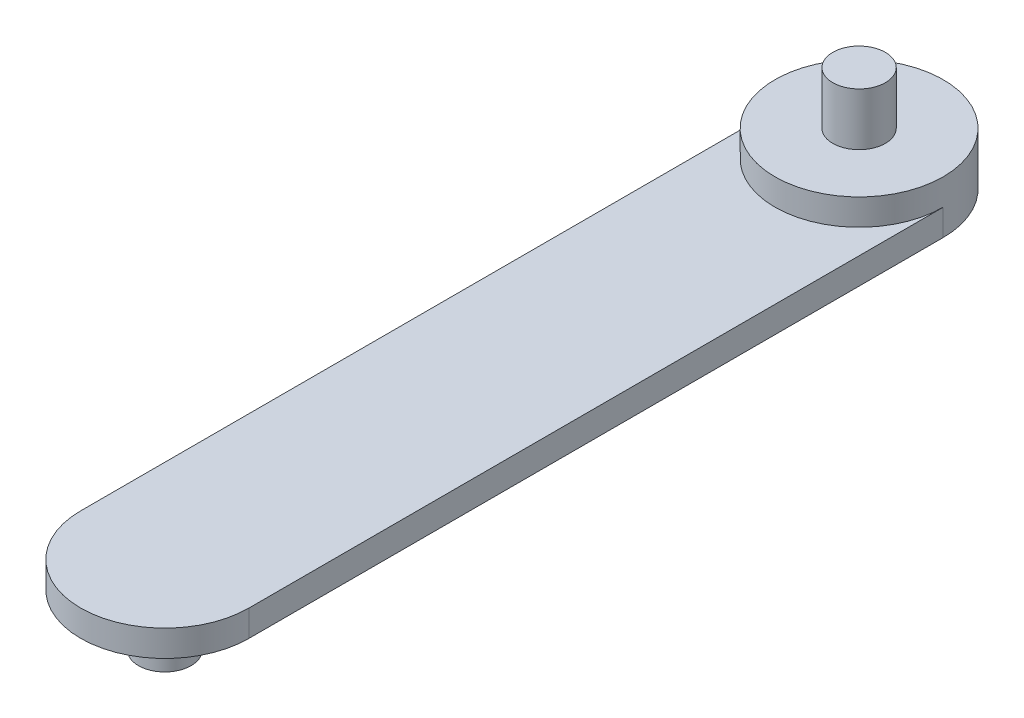
ISO-10303-21;
HEADER;
FILE_DESCRIPTION(('STEP AP214'),'2;1');
FILE_NAME('part.step','',(''),(''),'','','');
FILE_SCHEMA(('AUTOMOTIVE_DESIGN { 1 0 10303 214 1 1 1 1 }'));
ENDSEC;
DATA;
#1=APPLICATION_CONTEXT('core data for automotive mechanical design processes');
#2=APPLICATION_PROTOCOL_DEFINITION('international standard','automotive_design',2000,#1);
#3=PRODUCT_CONTEXT('',#1,'mechanical');
#4=PRODUCT('Part','Part','',(#3));
#5=PRODUCT_RELATED_PRODUCT_CATEGORY('part','',(#4));
#6=PRODUCT_DEFINITION_FORMATION('','',#4);
#7=PRODUCT_DEFINITION_CONTEXT('part definition',#1,'design');
#8=PRODUCT_DEFINITION('design','',#6,#7);
#9=PRODUCT_DEFINITION_SHAPE('','',#8);
#10=(LENGTH_UNIT() NAMED_UNIT(*) SI_UNIT(.MILLI.,.METRE.));
#11=(NAMED_UNIT(*) PLANE_ANGLE_UNIT() SI_UNIT($,.RADIAN.));
#12=(NAMED_UNIT(*) SI_UNIT($,.STERADIAN.) SOLID_ANGLE_UNIT());
#13=UNCERTAINTY_MEASURE_WITH_UNIT(LENGTH_MEASURE(1.E-05),#10,'distance_accuracy_value','');
#14=(GEOMETRIC_REPRESENTATION_CONTEXT(3) GLOBAL_UNCERTAINTY_ASSIGNED_CONTEXT((#13)) GLOBAL_UNIT_ASSIGNED_CONTEXT((#10,
#11,#12)) REPRESENTATION_CONTEXT('',''));
#15=CARTESIAN_POINT('',(0.,0.,0.));
#16=DIRECTION('',(0.,0.,1.));
#17=DIRECTION('',(1.,0.,0.));
#18=AXIS2_PLACEMENT_3D('',#15,#16,#17);
#19=CARTESIAN_POINT('',(0.,2.5,-33.));
#20=DIRECTION('',(0.,-1.,0.));
#21=DIRECTION('',(0.,0.,-1.));
#22=AXIS2_PLACEMENT_3D('',#19,#20,#21);
#23=CYLINDRICAL_SURFACE('',#22,4.);
#24=CARTESIAN_POINT('',(0.,1.25,-33.));
#25=DIRECTION('',(0.,1.,0.));
#26=DIRECTION('',(0.,0.,1.));
#27=AXIS2_PLACEMENT_3D('',#24,#25,#26);
#28=CIRCLE('',#27,4.);
#29=CARTESIAN_POINT('',(-4.,1.25,-33.));
#30=VERTEX_POINT('',#29);
#31=CARTESIAN_POINT('',(4.,1.25,-33.));
#32=VERTEX_POINT('',#31);
#33=EDGE_CURVE('E47',#30,#32,#28,.T.);
#34=ORIENTED_EDGE('',*,*,#33,.T.);
#35=DIRECTION('',(0.,-1.,0.));
#36=VECTOR('',#35,1.);
#37=CARTESIAN_POINT('',(4.,1.25,-33.));
#38=LINE('',#37,#36);
#39=CARTESIAN_POINT('',(4.,0.,-33.));
#40=VERTEX_POINT('',#39);
#41=EDGE_CURVE('E105',#32,#40,#38,.T.);
#42=ORIENTED_EDGE('',*,*,#41,.T.);
#43=CARTESIAN_POINT('',(0.,0.,-33.));
#44=DIRECTION('',(0.,1.,0.));
#45=DIRECTION('',(0.,0.,1.));
#46=AXIS2_PLACEMENT_3D('',#43,#44,#45);
#47=CIRCLE('',#46,4.);
#48=CARTESIAN_POINT('',(-4.,0.,-33.));
#49=VERTEX_POINT('',#48);
#50=EDGE_CURVE('E107',#40,#49,#47,.T.);
#51=ORIENTED_EDGE('',*,*,#50,.T.);
#52=DIRECTION('',(0.,-1.,0.));
#53=VECTOR('',#52,1.);
#54=CARTESIAN_POINT('',(-4.,1.25,-33.));
#55=LINE('',#54,#53);
#56=EDGE_CURVE('E52',#30,#49,#55,.T.);
#57=ORIENTED_EDGE('',*,*,#56,.F.);
#58=EDGE_LOOP('',(#34,#42,#51,#57));
#59=FACE_BOUND('',#58,.T.);
#60=CARTESIAN_POINT('',(0.,2.5,-33.));
#61=DIRECTION('',(0.,1.,0.));
#62=DIRECTION('',(0.,0.,1.));
#63=AXIS2_PLACEMENT_3D('',#60,#61,#62);
#64=CIRCLE('',#63,4.);
#65=CARTESIAN_POINT('',(0.,2.5,-29.));
#66=VERTEX_POINT('',#65);
#67=EDGE_CURVE('E108',#66,#66,#64,.T.);
#68=ORIENTED_EDGE('',*,*,#67,.F.);
#69=EDGE_LOOP('',(#68));
#70=FACE_BOUND('',#69,.T.);
#71=ADVANCED_FACE('F33',(#59,#70),#23,.T.);
#72=CARTESIAN_POINT('',(0.,2.5,0.));
#73=DIRECTION('',(0.,1.,0.));
#74=DIRECTION('',(0.,0.,1.));
#75=AXIS2_PLACEMENT_3D('',#72,#73,#74);
#76=PLANE('',#75);
#77=CARTESIAN_POINT('',(0.,2.5,-33.));
#78=DIRECTION('',(0.,1.,0.));
#79=DIRECTION('',(0.,0.,1.));
#80=AXIS2_PLACEMENT_3D('',#77,#78,#79);
#81=CIRCLE('',#80,1.25);
#82=CARTESIAN_POINT('',(0.,2.5,-31.75));
#83=VERTEX_POINT('',#82);
#84=EDGE_CURVE('E40',#83,#83,#81,.T.);
#85=ORIENTED_EDGE('',*,*,#84,.F.);
#86=EDGE_LOOP('',(#85));
#87=FACE_BOUND('',#86,.T.);
#88=ORIENTED_EDGE('',*,*,#67,.T.);
#89=EDGE_LOOP('',(#88));
#90=FACE_BOUND('',#89,.T.);
#91=ADVANCED_FACE('F136',(#87,#90),#76,.T.);
#92=CARTESIAN_POINT('',(0.,0.,0.));
#93=DIRECTION('',(0.,1.,0.));
#94=DIRECTION('',(0.,0.,1.));
#95=AXIS2_PLACEMENT_3D('',#92,#93,#94);
#96=PLANE('',#95);
#97=CARTESIAN_POINT('',(0.,0.,0.));
#98=DIRECTION('',(0.,1.,0.));
#99=DIRECTION('',(0.,0.,1.));
#100=AXIS2_PLACEMENT_3D('',#97,#98,#99);
#101=CIRCLE('',#100,1.25);
#102=CARTESIAN_POINT('',(0.,0.,1.25));
#103=VERTEX_POINT('',#102);
#104=EDGE_CURVE('E11',#103,#103,#101,.F.);
#105=ORIENTED_EDGE('',*,*,#104,.F.);
#106=EDGE_LOOP('',(#105));
#107=FACE_BOUND('',#106,.T.);
#108=ORIENTED_EDGE('',*,*,#50,.F.);
#109=DIRECTION('',(0.,0.,-1.));
#110=VECTOR('',#109,1.);
#111=CARTESIAN_POINT('',(4.,0.,0.));
#112=LINE('',#111,#110);
#113=CARTESIAN_POINT('',(4.,0.,0.));
#114=VERTEX_POINT('',#113);
#115=EDGE_CURVE('E96',#114,#40,#112,.T.);
#116=ORIENTED_EDGE('',*,*,#115,.F.);
#117=CARTESIAN_POINT('',(0.,0.,0.));
#118=DIRECTION('',(0.,1.,0.));
#119=DIRECTION('',(0.,0.,1.));
#120=AXIS2_PLACEMENT_3D('',#117,#118,#119);
#121=CIRCLE('',#120,4.);
#122=CARTESIAN_POINT('',(-4.,0.,0.));
#123=VERTEX_POINT('',#122);
#124=EDGE_CURVE('E101',#123,#114,#121,.T.);
#125=ORIENTED_EDGE('',*,*,#124,.F.);
#126=DIRECTION('',(0.,0.,-1.));
#127=VECTOR('',#126,1.);
#128=CARTESIAN_POINT('',(-4.,0.,0.));
#129=LINE('',#128,#127);
#130=EDGE_CURVE('E78',#123,#49,#129,.T.);
#131=ORIENTED_EDGE('',*,*,#130,.T.);
#132=EDGE_LOOP('',(#108,#116,#125,#131));
#133=FACE_BOUND('',#132,.T.);
#134=ADVANCED_FACE('F114',(#107,#133),#96,.F.);
#135=CARTESIAN_POINT('',(4.,1.25,0.));
#136=DIRECTION('',(-1.,0.,0.));
#137=DIRECTION('',(0.,0.,1.));
#138=AXIS2_PLACEMENT_3D('',#135,#136,#137);
#139=PLANE('',#138);
#140=ORIENTED_EDGE('',*,*,#115,.T.);
#141=ORIENTED_EDGE('',*,*,#41,.F.);
#142=DIRECTION('',(0.,0.,-1.));
#143=VECTOR('',#142,1.);
#144=CARTESIAN_POINT('',(4.,1.25,0.));
#145=LINE('',#144,#143);
#146=CARTESIAN_POINT('',(4.,1.25,0.));
#147=VERTEX_POINT('',#146);
#148=EDGE_CURVE('E92',#147,#32,#145,.T.);
#149=ORIENTED_EDGE('',*,*,#148,.F.);
#150=DIRECTION('',(0.,-1.,0.));
#151=VECTOR('',#150,1.);
#152=CARTESIAN_POINT('',(4.,1.25,0.));
#153=LINE('',#152,#151);
#154=EDGE_CURVE('E81',#147,#114,#153,.T.);
#155=ORIENTED_EDGE('',*,*,#154,.T.);
#156=EDGE_LOOP('',(#140,#141,#149,#155));
#157=FACE_BOUND('',#156,.T.);
#158=ADVANCED_FACE('F116',(#157),#139,.F.);
#159=CARTESIAN_POINT('',(-4.,1.25,0.));
#160=DIRECTION('',(-1.,0.,0.));
#161=DIRECTION('',(0.,0.,1.));
#162=AXIS2_PLACEMENT_3D('',#159,#160,#161);
#163=PLANE('',#162);
#164=ORIENTED_EDGE('',*,*,#130,.F.);
#165=DIRECTION('',(0.,-1.,0.));
#166=VECTOR('',#165,1.);
#167=CARTESIAN_POINT('',(-4.,1.25,0.));
#168=LINE('',#167,#166);
#169=CARTESIAN_POINT('',(-4.,1.25,0.));
#170=VERTEX_POINT('',#169);
#171=EDGE_CURVE('E72',#170,#123,#168,.T.);
#172=ORIENTED_EDGE('',*,*,#171,.F.);
#173=DIRECTION('',(0.,0.,-1.));
#174=VECTOR('',#173,1.);
#175=CARTESIAN_POINT('',(-4.,1.25,0.));
#176=LINE('',#175,#174);
#177=EDGE_CURVE('E76',#170,#30,#176,.T.);
#178=ORIENTED_EDGE('',*,*,#177,.T.);
#179=ORIENTED_EDGE('',*,*,#56,.T.);
#180=EDGE_LOOP('',(#164,#172,#178,#179));
#181=FACE_BOUND('',#180,.T.);
#182=ADVANCED_FACE('F74',(#181),#163,.T.);
#183=CARTESIAN_POINT('',(0.,1.25,0.));
#184=DIRECTION('',(0.,-1.,0.));
#185=DIRECTION('',(0.,0.,-1.));
#186=AXIS2_PLACEMENT_3D('',#183,#184,#185);
#187=CYLINDRICAL_SURFACE('',#186,4.);
#188=ORIENTED_EDGE('',*,*,#124,.T.);
#189=ORIENTED_EDGE('',*,*,#154,.F.);
#190=CARTESIAN_POINT('',(0.,1.25,0.));
#191=DIRECTION('',(0.,1.,0.));
#192=DIRECTION('',(0.,0.,1.));
#193=AXIS2_PLACEMENT_3D('',#190,#191,#192);
#194=CIRCLE('',#193,4.);
#195=EDGE_CURVE('E84',#170,#147,#194,.T.);
#196=ORIENTED_EDGE('',*,*,#195,.F.);
#197=ORIENTED_EDGE('',*,*,#171,.T.);
#198=EDGE_LOOP('',(#188,#189,#196,#197));
#199=FACE_BOUND('',#198,.T.);
#200=ADVANCED_FACE('F85',(#199),#187,.T.);
#201=CARTESIAN_POINT('',(0.,1.25,0.));
#202=DIRECTION('',(0.,1.,0.));
#203=DIRECTION('',(0.,0.,1.));
#204=AXIS2_PLACEMENT_3D('',#201,#202,#203);
#205=PLANE('',#204);
#206=ORIENTED_EDGE('',*,*,#148,.T.);
#207=ORIENTED_EDGE('',*,*,#33,.F.);
#208=ORIENTED_EDGE('',*,*,#177,.F.);
#209=ORIENTED_EDGE('',*,*,#195,.T.);
#210=EDGE_LOOP('',(#206,#207,#208,#209));
#211=FACE_BOUND('',#210,.T.);
#212=ADVANCED_FACE('F90',(#211),#205,.T.);
#213=CARTESIAN_POINT('',(0.,5.,-33.));
#214=DIRECTION('',(0.,-1.,0.));
#215=DIRECTION('',(0.,0.,-1.));
#216=AXIS2_PLACEMENT_3D('',#213,#214,#215);
#217=CYLINDRICAL_SURFACE('',#216,1.25);
#218=CARTESIAN_POINT('',(0.,5.,-33.));
#219=DIRECTION('',(0.,1.,0.));
#220=DIRECTION('',(0.,0.,1.));
#221=AXIS2_PLACEMENT_3D('',#218,#219,#220);
#222=CIRCLE('',#221,1.25);
#223=CARTESIAN_POINT('',(0.,5.,-31.75));
#224=VERTEX_POINT('',#223);
#225=EDGE_CURVE('E99',#224,#224,#222,.T.);
#226=ORIENTED_EDGE('',*,*,#225,.F.);
#227=EDGE_LOOP('',(#226));
#228=FACE_BOUND('',#227,.T.);
#229=ORIENTED_EDGE('',*,*,#84,.T.);
#230=EDGE_LOOP('',(#229));
#231=FACE_BOUND('',#230,.T.);
#232=ADVANCED_FACE('F163',(#228,#231),#217,.T.);
#233=CARTESIAN_POINT('',(0.,5.,-33.));
#234=DIRECTION('',(0.,1.,0.));
#235=DIRECTION('',(0.,0.,1.));
#236=AXIS2_PLACEMENT_3D('',#233,#234,#235);
#237=PLANE('',#236);
#238=ORIENTED_EDGE('',*,*,#225,.T.);
#239=EDGE_LOOP('',(#238));
#240=FACE_BOUND('',#239,.T.);
#241=ADVANCED_FACE('F131',(#240),#237,.T.);
#242=CARTESIAN_POINT('',(0.,-2.5,0.));
#243=DIRECTION('',(0.,1.,0.));
#244=DIRECTION('',(0.,0.,1.));
#245=AXIS2_PLACEMENT_3D('',#242,#243,#244);
#246=CYLINDRICAL_SURFACE('',#245,1.25);
#247=CARTESIAN_POINT('',(0.,-2.5,0.));
#248=DIRECTION('',(0.,-1.,0.));
#249=DIRECTION('',(0.,0.,-1.));
#250=AXIS2_PLACEMENT_3D('',#247,#248,#249);
#251=CIRCLE('',#250,1.25);
#252=CARTESIAN_POINT('',(0.,-2.5,-1.25));
#253=VERTEX_POINT('',#252);
#254=EDGE_CURVE('E122',#253,#253,#251,.T.);
#255=ORIENTED_EDGE('',*,*,#254,.F.);
#256=EDGE_LOOP('',(#255));
#257=FACE_BOUND('',#256,.T.);
#258=ORIENTED_EDGE('',*,*,#104,.T.);
#259=EDGE_LOOP('',(#258));
#260=FACE_BOUND('',#259,.T.);
#261=ADVANCED_FACE('F128',(#257,#260),#246,.T.);
#262=CARTESIAN_POINT('',(0.,-2.5,0.));
#263=DIRECTION('',(0.,-1.,0.));
#264=DIRECTION('',(0.,0.,-1.));
#265=AXIS2_PLACEMENT_3D('',#262,#263,#264);
#266=PLANE('',#265);
#267=ORIENTED_EDGE('',*,*,#254,.T.);
#268=EDGE_LOOP('',(#267));
#269=FACE_BOUND('',#268,.T.);
#270=ADVANCED_FACE('F126',(#269),#266,.T.);
#271=CLOSED_SHELL('',(#71,#91,#134,#158,#182,#200,#212,#232,#241,#261,#270));
#272=MANIFOLD_SOLID_BREP('B2',#271);
#273=ADVANCED_BREP_SHAPE_REPRESENTATION('',(#18,#272),#14);
#274=SHAPE_DEFINITION_REPRESENTATION(#9,#273);
ENDSEC;
END-ISO-10303-21;
